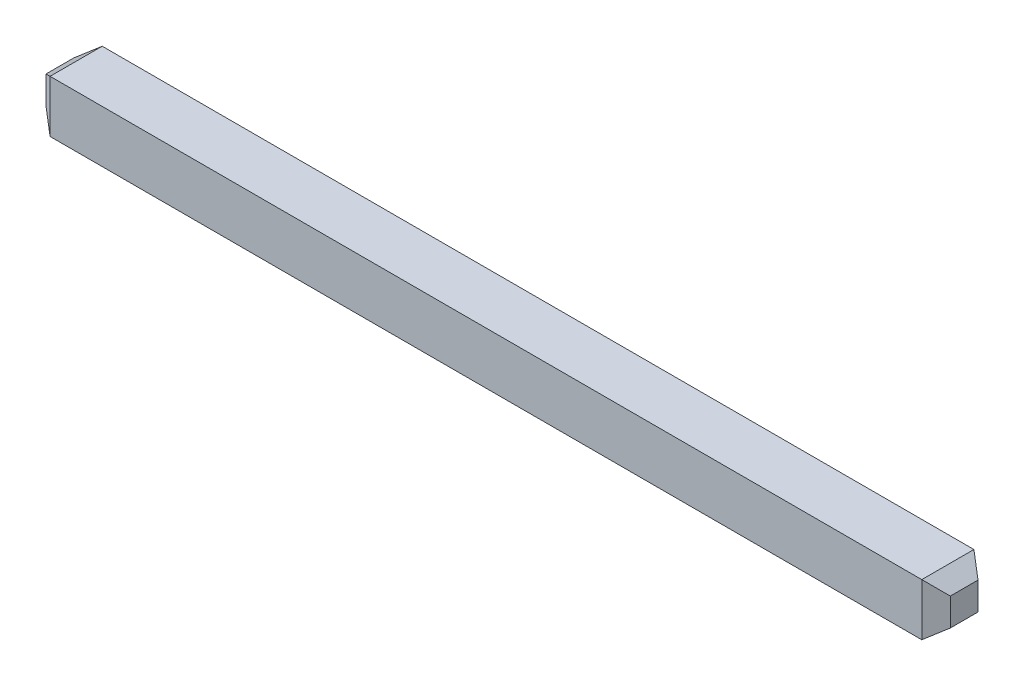
ISO-10303-21;
HEADER;
FILE_DESCRIPTION(('STEP AP214'),'2;1');
FILE_NAME('part.step','',(''),(''),'','','');
FILE_SCHEMA(('AUTOMOTIVE_DESIGN { 1 0 10303 214 1 1 1 1 }'));
ENDSEC;
DATA;
#1=APPLICATION_CONTEXT('core data for automotive mechanical design processes');
#2=APPLICATION_PROTOCOL_DEFINITION('international standard','automotive_design',2000,#1);
#3=PRODUCT_CONTEXT('',#1,'mechanical');
#4=PRODUCT('Part','Part','',(#3));
#5=PRODUCT_RELATED_PRODUCT_CATEGORY('part','',(#4));
#6=PRODUCT_DEFINITION_FORMATION('','',#4);
#7=PRODUCT_DEFINITION_CONTEXT('part definition',#1,'design');
#8=PRODUCT_DEFINITION('design','',#6,#7);
#9=PRODUCT_DEFINITION_SHAPE('','',#8);
#10=(LENGTH_UNIT() NAMED_UNIT(*) SI_UNIT(.MILLI.,.METRE.));
#11=(NAMED_UNIT(*) PLANE_ANGLE_UNIT() SI_UNIT($,.RADIAN.));
#12=(NAMED_UNIT(*) SI_UNIT($,.STERADIAN.) SOLID_ANGLE_UNIT());
#13=UNCERTAINTY_MEASURE_WITH_UNIT(LENGTH_MEASURE(1.E-05),#10,'distance_accuracy_value','');
#14=(GEOMETRIC_REPRESENTATION_CONTEXT(3) GLOBAL_UNCERTAINTY_ASSIGNED_CONTEXT((#13)) GLOBAL_UNIT_ASSIGNED_CONTEXT((#10,
#11,#12)) REPRESENTATION_CONTEXT('',''));
#15=CARTESIAN_POINT('',(0.,0.,0.));
#16=DIRECTION('',(0.,0.,1.));
#17=DIRECTION('',(1.,0.,0.));
#18=AXIS2_PLACEMENT_3D('',#15,#16,#17);
#19=CARTESIAN_POINT('',(-2.4,3.525,-19.05));
#20=DIRECTION('',(0.6,0.8,0.));
#21=DIRECTION('',(-0.8,0.6,0.));
#22=AXIS2_PLACEMENT_3D('',#19,#20,#21);
#23=PLANE('',#22);
#24=DIRECTION('',(0.,0.,1.));
#25=VECTOR('',#24,1.);
#26=CARTESIAN_POINT('',(-2.3,3.45,-19.05));
#27=LINE('',#26,#25);
#28=CARTESIAN_POINT('',(-2.29999999999978,3.45,-19.3699999999997));
#29=VERTEX_POINT('',#28);
#30=CARTESIAN_POINT('',(-2.29999999999978,3.45,-18.7300000000003));
#31=VERTEX_POINT('',#30);
#32=EDGE_CURVE('E105',#29,#31,#27,.T.);
#33=ORIENTED_EDGE('',*,*,#32,.T.);
#34=DIRECTION('',(0.685994340575993,-0.514495755427528,0.514495755419581));
#35=VECTOR('',#34,1.);
#36=CARTESIAN_POINT('',(-2.50000000000087,3.6,-18.8799999999988));
#37=LINE('',#36,#35);
#38=CARTESIAN_POINT('',(-2.50000000000022,3.6,-18.8799999999997));
#39=VERTEX_POINT('',#38);
#40=EDGE_CURVE('E92',#39,#31,#37,.T.);
#41=ORIENTED_EDGE('',*,*,#40,.F.);
#42=DIRECTION('',(0.,0.,-1.));
#43=VECTOR('',#42,1.);
#44=CARTESIAN_POINT('',(-2.5,3.6,-19.05));
#45=LINE('',#44,#43);
#46=CARTESIAN_POINT('',(-2.50000000000043,3.6,-19.2200000000006));
#47=VERTEX_POINT('',#46);
#48=EDGE_CURVE('E79',#39,#47,#45,.T.);
#49=ORIENTED_EDGE('',*,*,#48,.T.);
#50=DIRECTION('',(0.685994340575952,-0.514495755427526,-0.514495755419639));
#51=VECTOR('',#50,1.);
#52=CARTESIAN_POINT('',(-2.50000000000086,3.6,-19.2200000000012));
#53=LINE('',#52,#51);
#54=EDGE_CURVE('E20',#47,#29,#53,.T.);
#55=ORIENTED_EDGE('',*,*,#54,.T.);
#56=EDGE_LOOP('',(#33,#41,#49,#55));
#57=FACE_BOUND('',#56,.T.);
#58=ADVANCED_FACE('F17',(#57),#23,.F.);
#59=CARTESIAN_POINT('',(8.5,3.525,-19.05));
#60=DIRECTION('',(-0.6,0.8,0.));
#61=DIRECTION('',(-0.8,-0.6,0.));
#62=AXIS2_PLACEMENT_3D('',#59,#60,#61);
#63=PLANE('',#62);
#64=DIRECTION('',(0.,0.,-1.));
#65=VECTOR('',#64,1.);
#66=CARTESIAN_POINT('',(8.6,3.6,-19.05));
#67=LINE('',#66,#65);
#68=CARTESIAN_POINT('',(8.60000000000043,3.6,-18.8799999999994));
#69=VERTEX_POINT('',#68);
#70=CARTESIAN_POINT('',(8.60000000000021,3.6,-19.2200000000003));
#71=VERTEX_POINT('',#70);
#72=EDGE_CURVE('E114',#69,#71,#67,.T.);
#73=ORIENTED_EDGE('',*,*,#72,.F.);
#74=DIRECTION('',(0.685994340575991,0.514495755427529,-0.514495755419583));
#75=VECTOR('',#74,1.);
#76=CARTESIAN_POINT('',(8.39999999999913,3.45,-18.7300000000012));
#77=LINE('',#76,#75);
#78=CARTESIAN_POINT('',(8.39999999999989,3.45,-18.7300000000001));
#79=VERTEX_POINT('',#78);
#80=EDGE_CURVE('E109',#79,#69,#77,.T.);
#81=ORIENTED_EDGE('',*,*,#80,.F.);
#82=DIRECTION('',(0.,0.,1.));
#83=VECTOR('',#82,1.);
#84=CARTESIAN_POINT('',(8.4,3.45,-19.05));
#85=LINE('',#84,#83);
#86=CARTESIAN_POINT('',(8.39999999999979,3.45,-19.3699999999997));
#87=VERTEX_POINT('',#86);
#88=EDGE_CURVE('E103',#79,#87,#85,.F.);
#89=ORIENTED_EDGE('',*,*,#88,.T.);
#90=DIRECTION('',(0.685994340575951,0.514495755427526,0.514495755419639));
#91=VECTOR('',#90,1.);
#92=CARTESIAN_POINT('',(8.39999999999914,3.45,-19.3699999999989));
#93=LINE('',#92,#91);
#94=EDGE_CURVE('E107',#87,#71,#93,.T.);
#95=ORIENTED_EDGE('',*,*,#94,.T.);
#96=EDGE_LOOP('',(#73,#81,#89,#95));
#97=FACE_BOUND('',#96,.T.);
#98=ADVANCED_FACE('F175',(#97),#63,.F.);
#99=CARTESIAN_POINT('',(-2.4,3.77,-19.295));
#100=DIRECTION('',(0.5999999999908,0.,0.8000000000069));
#101=DIRECTION('',(0.8000000000069,0.,-0.5999999999908));
#102=AXIS2_PLACEMENT_3D('',#99,#100,#101);
#103=PLANE('',#102);
#104=DIRECTION('',(0.,1.,0.));
#105=VECTOR('',#104,1.);
#106=CARTESIAN_POINT('',(-2.3,3.77,-19.37));
#107=LINE('',#106,#105);
#108=CARTESIAN_POINT('',(-2.29999999999957,4.09,-19.3699999999994));
#109=VERTEX_POINT('',#108);
#110=EDGE_CURVE('E88',#109,#29,#107,.F.);
#111=ORIENTED_EDGE('',*,*,#110,.T.);
#112=ORIENTED_EDGE('',*,*,#54,.F.);
#113=DIRECTION('',(0.,1.,0.));
#114=VECTOR('',#113,1.);
#115=CARTESIAN_POINT('',(-2.5,3.77,-19.22));
#116=LINE('',#115,#114);
#117=CARTESIAN_POINT('',(-2.50000000000043,3.94,-19.2200000000006));
#118=VERTEX_POINT('',#117);
#119=EDGE_CURVE('E85',#47,#118,#116,.T.);
#120=ORIENTED_EDGE('',*,*,#119,.T.);
#121=DIRECTION('',(-0.685994340570035,-0.514495755427526,0.514495755427529));
#122=VECTOR('',#121,1.);
#123=CARTESIAN_POINT('',(-2.3,4.09,-19.37));
#124=LINE('',#123,#122);
#125=EDGE_CURVE('E126',#109,#118,#124,.T.);
#126=ORIENTED_EDGE('',*,*,#125,.F.);
#127=EDGE_LOOP('',(#111,#112,#120,#126));
#128=FACE_BOUND('',#127,.T.);
#129=ADVANCED_FACE('F84',(#128),#103,.F.);
#130=CARTESIAN_POINT('',(-2.5,3.77,-19.05));
#131=DIRECTION('',(1.,0.,0.));
#132=DIRECTION('',(0.,0.,-1.));
#133=AXIS2_PLACEMENT_3D('',#130,#131,#132);
#134=PLANE('',#133);
#135=DIRECTION('',(0.,1.,0.));
#136=VECTOR('',#135,1.);
#137=CARTESIAN_POINT('',(-2.50000000000087,3.77,-18.8799999999988));
#138=LINE('',#137,#136);
#139=CARTESIAN_POINT('',(-2.50000000000022,3.94,-18.8799999999997));
#140=VERTEX_POINT('',#139);
#141=EDGE_CURVE('E94',#140,#39,#138,.F.);
#142=ORIENTED_EDGE('',*,*,#141,.F.);
#143=DIRECTION('',(0.,0.,1.));
#144=VECTOR('',#143,1.);
#145=CARTESIAN_POINT('',(-2.5,3.94,-19.05));
#146=LINE('',#145,#144);
#147=EDGE_CURVE('E98',#118,#140,#146,.T.);
#148=ORIENTED_EDGE('',*,*,#147,.F.);
#149=ORIENTED_EDGE('',*,*,#119,.F.);
#150=ORIENTED_EDGE('',*,*,#48,.F.);
#151=EDGE_LOOP('',(#142,#148,#149,#150));
#152=FACE_BOUND('',#151,.T.);
#153=ADVANCED_FACE('F96',(#152),#134,.F.);
#154=CARTESIAN_POINT('',(-2.4,3.77,-18.805));
#155=DIRECTION('',(-0.599999999990736,0.,0.800000000006948));
#156=DIRECTION('',(0.800000000006948,0.,0.599999999990736));
#157=AXIS2_PLACEMENT_3D('',#154,#155,#156);
#158=PLANE('',#157);
#159=ORIENTED_EDGE('',*,*,#40,.T.);
#160=DIRECTION('',(0.,1.,0.));
#161=VECTOR('',#160,1.);
#162=CARTESIAN_POINT('',(-2.3,3.77,-18.73));
#163=LINE('',#162,#161);
#164=CARTESIAN_POINT('',(-2.29999999999957,4.09,-18.7300000000006));
#165=VERTEX_POINT('',#164);
#166=EDGE_CURVE('E132',#165,#31,#163,.F.);
#167=ORIENTED_EDGE('',*,*,#166,.F.);
#168=DIRECTION('',(0.685994340570035,0.514495755427526,0.514495755427529));
#169=VECTOR('',#168,1.);
#170=CARTESIAN_POINT('',(-2.5,3.94,-18.88));
#171=LINE('',#170,#169);
#172=EDGE_CURVE('E129',#140,#165,#171,.T.);
#173=ORIENTED_EDGE('',*,*,#172,.F.);
#174=ORIENTED_EDGE('',*,*,#141,.T.);
#175=EDGE_LOOP('',(#159,#167,#173,#174));
#176=FACE_BOUND('',#175,.T.);
#177=ADVANCED_FACE('F186',(#176),#158,.T.);
#178=CARTESIAN_POINT('',(3.05,3.45,-19.05));
#179=DIRECTION('',(0.,1.,0.));
#180=DIRECTION('',(0.,0.,1.));
#181=AXIS2_PLACEMENT_3D('',#178,#179,#180);
#182=PLANE('',#181);
#183=ORIENTED_EDGE('',*,*,#32,.F.);
#184=DIRECTION('',(1.,0.,0.));
#185=VECTOR('',#184,1.);
#186=CARTESIAN_POINT('',(3.05,3.45,-19.37));
#187=LINE('',#186,#185);
#188=EDGE_CURVE('E123',#29,#87,#187,.T.);
#189=ORIENTED_EDGE('',*,*,#188,.T.);
#190=ORIENTED_EDGE('',*,*,#88,.F.);
#191=DIRECTION('',(1.,0.,0.));
#192=VECTOR('',#191,1.);
#193=CARTESIAN_POINT('',(3.05,3.45,-18.73));
#194=LINE('',#193,#192);
#195=EDGE_CURVE('E135',#31,#79,#194,.T.);
#196=ORIENTED_EDGE('',*,*,#195,.F.);
#197=EDGE_LOOP('',(#183,#189,#190,#196));
#198=FACE_BOUND('',#197,.T.);
#199=ADVANCED_FACE('F179',(#198),#182,.F.);
#200=CARTESIAN_POINT('',(8.5,3.77,-19.295));
#201=DIRECTION('',(-0.5999999999908,0.,0.8000000000069));
#202=DIRECTION('',(0.8000000000069,0.,0.5999999999908));
#203=AXIS2_PLACEMENT_3D('',#200,#201,#202);
#204=PLANE('',#203);
#205=DIRECTION('',(0.,1.,0.));
#206=VECTOR('',#205,1.);
#207=CARTESIAN_POINT('',(8.6,3.77,-19.22));
#208=LINE('',#207,#206);
#209=CARTESIAN_POINT('',(8.60000000000043,3.94,-19.2200000000006));
#210=VERTEX_POINT('',#209);
#211=EDGE_CURVE('E117',#71,#210,#208,.T.);
#212=ORIENTED_EDGE('',*,*,#211,.F.);
#213=ORIENTED_EDGE('',*,*,#94,.F.);
#214=DIRECTION('',(0.,1.,0.));
#215=VECTOR('',#214,1.);
#216=CARTESIAN_POINT('',(8.4,3.77,-19.37));
#217=LINE('',#216,#215);
#218=CARTESIAN_POINT('',(8.39999999999957,4.09,-19.3699999999994));
#219=VERTEX_POINT('',#218);
#220=EDGE_CURVE('E120',#87,#219,#217,.T.);
#221=ORIENTED_EDGE('',*,*,#220,.T.);
#222=DIRECTION('',(-0.685994340570033,0.514495755427525,-0.514495755427531));
#223=VECTOR('',#222,1.);
#224=CARTESIAN_POINT('',(8.6,3.94,-19.22));
#225=LINE('',#224,#223);
#226=EDGE_CURVE('E140',#210,#219,#225,.T.);
#227=ORIENTED_EDGE('',*,*,#226,.F.);
#228=EDGE_LOOP('',(#212,#213,#221,#227));
#229=FACE_BOUND('',#228,.T.);
#230=ADVANCED_FACE('F167',(#229),#204,.F.);
#231=CARTESIAN_POINT('',(8.5,3.77,-18.805));
#232=DIRECTION('',(0.599999999990736,0.,0.800000000006948));
#233=DIRECTION('',(0.800000000006948,0.,-0.599999999990736));
#234=AXIS2_PLACEMENT_3D('',#231,#232,#233);
#235=PLANE('',#234);
#236=DIRECTION('',(0.685994340570033,-0.514495755427525,-0.514495755427531));
#237=VECTOR('',#236,1.);
#238=CARTESIAN_POINT('',(8.4,4.09,-18.73));
#239=LINE('',#238,#237);
#240=CARTESIAN_POINT('',(8.39999999999957,4.09,-18.7300000000006));
#241=VERTEX_POINT('',#240);
#242=CARTESIAN_POINT('',(8.60000000000043,3.94,-18.8799999999994));
#243=VERTEX_POINT('',#242);
#244=EDGE_CURVE('E35',#241,#243,#239,.T.);
#245=ORIENTED_EDGE('',*,*,#244,.F.);
#246=DIRECTION('',(0.,1.,0.));
#247=VECTOR('',#246,1.);
#248=CARTESIAN_POINT('',(8.4,3.77,-18.73));
#249=LINE('',#248,#247);
#250=EDGE_CURVE('E138',#79,#241,#249,.T.);
#251=ORIENTED_EDGE('',*,*,#250,.F.);
#252=ORIENTED_EDGE('',*,*,#80,.T.);
#253=DIRECTION('',(0.,1.,0.));
#254=VECTOR('',#253,1.);
#255=CARTESIAN_POINT('',(8.6,3.77,-18.88));
#256=LINE('',#255,#254);
#257=EDGE_CURVE('E111',#243,#69,#256,.F.);
#258=ORIENTED_EDGE('',*,*,#257,.F.);
#259=EDGE_LOOP('',(#245,#251,#252,#258));
#260=FACE_BOUND('',#259,.T.);
#261=ADVANCED_FACE('F211',(#260),#235,.T.);
#262=CARTESIAN_POINT('',(8.6,3.77,-19.05));
#263=DIRECTION('',(1.,0.,0.));
#264=DIRECTION('',(0.,0.,-1.));
#265=AXIS2_PLACEMENT_3D('',#262,#263,#264);
#266=PLANE('',#265);
#267=ORIENTED_EDGE('',*,*,#211,.T.);
#268=DIRECTION('',(0.,0.,1.));
#269=VECTOR('',#268,1.);
#270=CARTESIAN_POINT('',(8.6,3.94,-19.05));
#271=LINE('',#270,#269);
#272=EDGE_CURVE('E144',#243,#210,#271,.F.);
#273=ORIENTED_EDGE('',*,*,#272,.F.);
#274=ORIENTED_EDGE('',*,*,#257,.T.);
#275=ORIENTED_EDGE('',*,*,#72,.T.);
#276=EDGE_LOOP('',(#267,#273,#274,#275));
#277=FACE_BOUND('',#276,.T.);
#278=ADVANCED_FACE('F172',(#277),#266,.T.);
#279=CARTESIAN_POINT('',(3.05,3.77,-19.37));
#280=DIRECTION('',(0.,0.,1.));
#281=DIRECTION('',(1.,0.,0.));
#282=AXIS2_PLACEMENT_3D('',#279,#280,#281);
#283=PLANE('',#282);
#284=ORIENTED_EDGE('',*,*,#110,.F.);
#285=DIRECTION('',(1.,0.,0.));
#286=VECTOR('',#285,1.);
#287=CARTESIAN_POINT('',(3.05,4.09,-19.37));
#288=LINE('',#287,#286);
#289=EDGE_CURVE('E147',#219,#109,#288,.F.);
#290=ORIENTED_EDGE('',*,*,#289,.F.);
#291=ORIENTED_EDGE('',*,*,#220,.F.);
#292=ORIENTED_EDGE('',*,*,#188,.F.);
#293=EDGE_LOOP('',(#284,#290,#291,#292));
#294=FACE_BOUND('',#293,.T.);
#295=ADVANCED_FACE('F181',(#294),#283,.F.);
#296=CARTESIAN_POINT('',(-2.4,4.015,-19.05));
#297=DIRECTION('',(-0.6,0.8,0.));
#298=DIRECTION('',(-0.8,-0.6,0.));
#299=AXIS2_PLACEMENT_3D('',#296,#297,#298);
#300=PLANE('',#299);
#301=ORIENTED_EDGE('',*,*,#172,.T.);
#302=DIRECTION('',(0.,0.,1.));
#303=VECTOR('',#302,1.);
#304=CARTESIAN_POINT('',(-2.3,4.09,-19.05));
#305=LINE('',#304,#303);
#306=EDGE_CURVE('E150',#109,#165,#305,.T.);
#307=ORIENTED_EDGE('',*,*,#306,.F.);
#308=ORIENTED_EDGE('',*,*,#125,.T.);
#309=ORIENTED_EDGE('',*,*,#147,.T.);
#310=EDGE_LOOP('',(#301,#307,#308,#309));
#311=FACE_BOUND('',#310,.T.);
#312=ADVANCED_FACE('F183',(#311),#300,.T.);
#313=CARTESIAN_POINT('',(3.05,3.77,-18.73));
#314=DIRECTION('',(0.,0.,1.));
#315=DIRECTION('',(1.,0.,0.));
#316=AXIS2_PLACEMENT_3D('',#313,#314,#315);
#317=PLANE('',#316);
#318=ORIENTED_EDGE('',*,*,#195,.T.);
#319=ORIENTED_EDGE('',*,*,#250,.T.);
#320=DIRECTION('',(1.,0.,0.));
#321=VECTOR('',#320,1.);
#322=CARTESIAN_POINT('',(3.05,4.09,-18.73));
#323=LINE('',#322,#321);
#324=EDGE_CURVE('E26',#165,#241,#323,.T.);
#325=ORIENTED_EDGE('',*,*,#324,.F.);
#326=ORIENTED_EDGE('',*,*,#166,.T.);
#327=EDGE_LOOP('',(#318,#319,#325,#326));
#328=FACE_BOUND('',#327,.T.);
#329=ADVANCED_FACE('F160',(#328),#317,.T.);
#330=CARTESIAN_POINT('',(8.5,4.015,-19.05));
#331=DIRECTION('',(0.6,0.8,0.));
#332=DIRECTION('',(-0.8,0.6,0.));
#333=AXIS2_PLACEMENT_3D('',#330,#331,#332);
#334=PLANE('',#333);
#335=ORIENTED_EDGE('',*,*,#244,.T.);
#336=ORIENTED_EDGE('',*,*,#272,.T.);
#337=ORIENTED_EDGE('',*,*,#226,.T.);
#338=DIRECTION('',(0.,0.,1.));
#339=VECTOR('',#338,1.);
#340=CARTESIAN_POINT('',(8.4,4.09,-19.05));
#341=LINE('',#340,#339);
#342=EDGE_CURVE('E11',#241,#219,#341,.F.);
#343=ORIENTED_EDGE('',*,*,#342,.F.);
#344=EDGE_LOOP('',(#335,#336,#337,#343));
#345=FACE_BOUND('',#344,.T.);
#346=ADVANCED_FACE('F163',(#345),#334,.T.);
#347=CARTESIAN_POINT('',(3.05,4.09,-19.05));
#348=DIRECTION('',(0.,1.,0.));
#349=DIRECTION('',(0.,0.,1.));
#350=AXIS2_PLACEMENT_3D('',#347,#348,#349);
#351=PLANE('',#350);
#352=ORIENTED_EDGE('',*,*,#324,.T.);
#353=ORIENTED_EDGE('',*,*,#342,.T.);
#354=ORIENTED_EDGE('',*,*,#289,.T.);
#355=ORIENTED_EDGE('',*,*,#306,.T.);
#356=EDGE_LOOP('',(#352,#353,#354,#355));
#357=FACE_BOUND('',#356,.T.);
#358=ADVANCED_FACE('F156',(#357),#351,.T.);
#359=CLOSED_SHELL('',(#58,#98,#129,#153,#177,#199,#230,#261,#278,#295,#312,#329,#346,#358));
#360=MANIFOLD_SOLID_BREP('B1',#359);
#361=ADVANCED_BREP_SHAPE_REPRESENTATION('',(#18,#360),#14);
#362=SHAPE_DEFINITION_REPRESENTATION(#9,#361);
ENDSEC;
END-ISO-10303-21;
